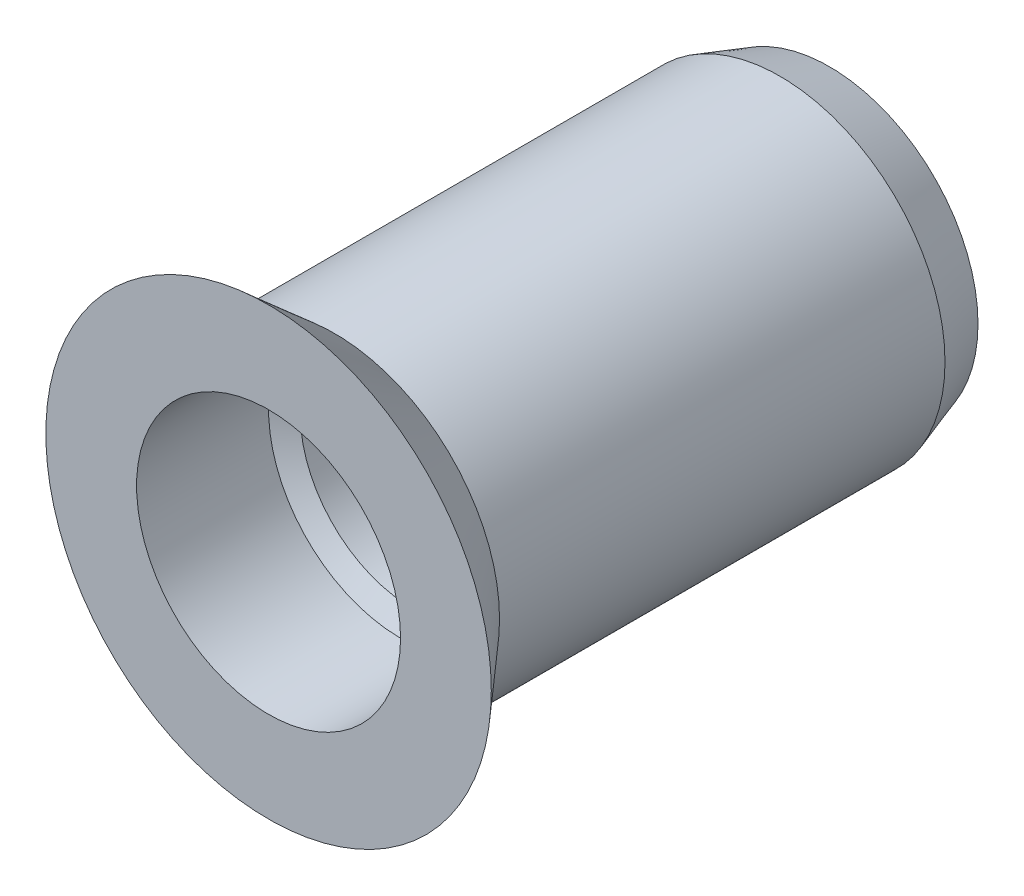
ISO-10303-21;
HEADER;
FILE_DESCRIPTION(('STEP AP214'),'2;1');
FILE_NAME('part.step','',(''),(''),'','','');
FILE_SCHEMA(('AUTOMOTIVE_DESIGN { 1 0 10303 214 1 1 1 1 }'));
ENDSEC;
DATA;
#1=APPLICATION_CONTEXT('core data for automotive mechanical design processes');
#2=APPLICATION_PROTOCOL_DEFINITION('international standard','automotive_design',2000,#1);
#3=PRODUCT_CONTEXT('',#1,'mechanical');
#4=PRODUCT('Part','Part','',(#3));
#5=PRODUCT_RELATED_PRODUCT_CATEGORY('part','',(#4));
#6=PRODUCT_DEFINITION_FORMATION('','',#4);
#7=PRODUCT_DEFINITION_CONTEXT('part definition',#1,'design');
#8=PRODUCT_DEFINITION('design','',#6,#7);
#9=PRODUCT_DEFINITION_SHAPE('','',#8);
#10=(LENGTH_UNIT() NAMED_UNIT(*) SI_UNIT(.MILLI.,.METRE.));
#11=(NAMED_UNIT(*) PLANE_ANGLE_UNIT() SI_UNIT($,.RADIAN.));
#12=(NAMED_UNIT(*) SI_UNIT($,.STERADIAN.) SOLID_ANGLE_UNIT());
#13=UNCERTAINTY_MEASURE_WITH_UNIT(LENGTH_MEASURE(1.E-05),#10,'distance_accuracy_value','');
#14=(GEOMETRIC_REPRESENTATION_CONTEXT(3) GLOBAL_UNCERTAINTY_ASSIGNED_CONTEXT((#13)) GLOBAL_UNIT_ASSIGNED_CONTEXT((#10,
#11,#12)) REPRESENTATION_CONTEXT('',''));
#15=CARTESIAN_POINT('',(0.,0.,0.));
#16=DIRECTION('',(0.,0.,1.));
#17=DIRECTION('',(1.,0.,0.));
#18=AXIS2_PLACEMENT_3D('',#15,#16,#17);
#19=CARTESIAN_POINT('',(0.,0.,-495000.));
#20=DIRECTION('',(0.,0.,-1.));
#21=DIRECTION('',(-1.,0.,0.));
#22=AXIS2_PLACEMENT_3D('',#19,#20,#21);
#23=CYLINDRICAL_SURFACE('',#22,3.4);
#24=CARTESIAN_POINT('',(0.,0.,-4.36051637211676));
#25=DIRECTION('',(0.,0.,1.));
#26=DIRECTION('',(1.,0.,0.));
#27=AXIS2_PLACEMENT_3D('',#24,#25,#26);
#28=CIRCLE('',#27,3.40000000039709);
#29=CARTESIAN_POINT('',(3.40000000039709,0.,-4.36051637211676));
#30=VERTEX_POINT('',#29);
#31=EDGE_CURVE('E41',#30,#30,#28,.T.);
#32=ORIENTED_EDGE('',*,*,#31,.T.);
#33=EDGE_LOOP('',(#32));
#34=FACE_BOUND('',#33,.T.);
#35=CARTESIAN_POINT('',(0.,0.,-16.3999999994076));
#36=DIRECTION('',(0.,0.,-1.));
#37=DIRECTION('',(-1.,0.,0.));
#38=AXIS2_PLACEMENT_3D('',#35,#36,#37);
#39=CIRCLE('',#38,3.40000000051077);
#40=CARTESIAN_POINT('',(-3.40000000051077,0.,-16.3999999994076));
#41=VERTEX_POINT('',#40);
#42=EDGE_CURVE('E36',#41,#41,#39,.T.);
#43=ORIENTED_EDGE('',*,*,#42,.T.);
#44=EDGE_LOOP('',(#43));
#45=FACE_BOUND('',#44,.T.);
#46=ADVANCED_FACE('F14',(#34,#45),#23,.F.);
#47=CARTESIAN_POINT('',(0.,0.,-4.0000000000191));
#48=DIRECTION('',(0.,0.,1.));
#49=DIRECTION('',(1.,0.,0.));
#50=AXIS2_PLACEMENT_3D('',#47,#48,#49);
#51=CONICAL_SURFACE('',#50,3.99999999996226,1.02974425752263);
#52=CARTESIAN_POINT('',(0.,0.,-4.));
#53=DIRECTION('',(0.,0.,1.));
#54=DIRECTION('',(1.,0.,0.));
#55=AXIS2_PLACEMENT_3D('',#52,#53,#54);
#56=CIRCLE('',#55,4.);
#57=CARTESIAN_POINT('',(4.,0.,-4.));
#58=VERTEX_POINT('',#57);
#59=EDGE_CURVE('E33',#58,#58,#56,.T.);
#60=ORIENTED_EDGE('',*,*,#59,.T.);
#61=EDGE_LOOP('',(#60));
#62=FACE_BOUND('',#61,.T.);
#63=ORIENTED_EDGE('',*,*,#31,.F.);
#64=EDGE_LOOP('',(#63));
#65=FACE_BOUND('',#64,.T.);
#66=ADVANCED_FACE('F93',(#62,#65),#51,.F.);
#67=CARTESIAN_POINT('',(0.,0.,-16.9999999999959));
#68=DIRECTION('',(0.,0.,-1.));
#69=DIRECTION('',(-1.,0.,0.));
#70=AXIS2_PLACEMENT_3D('',#67,#68,#69);
#71=CONICAL_SURFACE('',#70,4.0000000000191,0.785398162450058);
#72=CARTESIAN_POINT('',(0.,0.,-16.9999999999959));
#73=DIRECTION('',(0.,0.,-1.));
#74=DIRECTION('',(-1.,0.,0.));
#75=AXIS2_PLACEMENT_3D('',#72,#73,#74);
#76=CIRCLE('',#75,4.0000000000191);
#77=CARTESIAN_POINT('',(-4.0000000000191,0.,-16.9999999999959));
#78=VERTEX_POINT('',#77);
#79=EDGE_CURVE('E17',#78,#78,#76,.T.);
#80=ORIENTED_EDGE('',*,*,#79,.T.);
#81=EDGE_LOOP('',(#80));
#82=FACE_BOUND('',#81,.T.);
#83=ORIENTED_EDGE('',*,*,#42,.F.);
#84=EDGE_LOOP('',(#83));
#85=FACE_BOUND('',#84,.T.);
#86=ADVANCED_FACE('F59',(#82,#85),#71,.F.);
#87=CARTESIAN_POINT('',(0.,0.,-4.));
#88=DIRECTION('',(0.,0.,1.));
#89=DIRECTION('',(1.,0.,0.));
#90=AXIS2_PLACEMENT_3D('',#87,#88,#89);
#91=CYLINDRICAL_SURFACE('',#90,4.);
#92=CARTESIAN_POINT('',(0.,0.,0.));
#93=DIRECTION('',(0.,0.,1.));
#94=DIRECTION('',(1.,0.,0.));
#95=AXIS2_PLACEMENT_3D('',#92,#93,#94);
#96=CIRCLE('',#95,4.);
#97=CARTESIAN_POINT('',(4.,0.,0.));
#98=VERTEX_POINT('',#97);
#99=EDGE_CURVE('E52',#98,#98,#96,.T.);
#100=ORIENTED_EDGE('',*,*,#99,.T.);
#101=EDGE_LOOP('',(#100));
#102=FACE_BOUND('',#101,.T.);
#103=ORIENTED_EDGE('',*,*,#59,.F.);
#104=EDGE_LOOP('',(#103));
#105=FACE_BOUND('',#104,.T.);
#106=ADVANCED_FACE('F66',(#102,#105),#91,.F.);
#107=CARTESIAN_POINT('',(0.,-5.,-17.));
#108=DIRECTION('',(0.,0.,1.));
#109=DIRECTION('',(1.,0.,0.));
#110=AXIS2_PLACEMENT_3D('',#107,#108,#109);
#111=PLANE('',#110);
#112=ORIENTED_EDGE('',*,*,#79,.F.);
#113=EDGE_LOOP('',(#112));
#114=FACE_BOUND('',#113,.T.);
#115=CARTESIAN_POINT('',(0.,0.,-17.0000000000528));
#116=DIRECTION('',(0.,0.,1.));
#117=DIRECTION('',(1.,0.,0.));
#118=AXIS2_PLACEMENT_3D('',#115,#116,#117);
#119=CIRCLE('',#118,4.49999999997885);
#120=CARTESIAN_POINT('',(4.49999999997885,0.,-17.0000000000528));
#121=VERTEX_POINT('',#120);
#122=EDGE_CURVE('E50',#121,#121,#119,.T.);
#123=ORIENTED_EDGE('',*,*,#122,.F.);
#124=EDGE_LOOP('',(#123));
#125=FACE_BOUND('',#124,.T.);
#126=ADVANCED_FACE('F62',(#114,#125),#111,.F.);
#127=CARTESIAN_POINT('',(0.,0.,0.));
#128=DIRECTION('',(0.,0.,-1.));
#129=DIRECTION('',(-1.,0.,0.));
#130=AXIS2_PLACEMENT_3D('',#127,#128,#129);
#131=PLANE('',#130);
#132=CARTESIAN_POINT('',(0.,0.,0.));
#133=DIRECTION('',(0.,0.,1.));
#134=DIRECTION('',(1.,0.,0.));
#135=AXIS2_PLACEMENT_3D('',#132,#133,#134);
#136=CIRCLE('',#135,6.75000000001091);
#137=CARTESIAN_POINT('',(6.75000000001091,0.,0.));
#138=VERTEX_POINT('',#137);
#139=EDGE_CURVE('E26',#138,#138,#136,.F.);
#140=ORIENTED_EDGE('',*,*,#139,.F.);
#141=EDGE_LOOP('',(#140));
#142=FACE_BOUND('',#141,.T.);
#143=ORIENTED_EDGE('',*,*,#99,.F.);
#144=EDGE_LOOP('',(#143));
#145=FACE_BOUND('',#144,.T.);
#146=ADVANCED_FACE('F65',(#142,#145),#131,.F.);
#147=CARTESIAN_POINT('',(0.,0.,-15.499999999804));
#148=DIRECTION('',(0.,0.,1.));
#149=DIRECTION('',(1.,0.,0.));
#150=AXIS2_PLACEMENT_3D('',#147,#148,#149);
#151=CONICAL_SURFACE('',#150,4.99999999942702,0.321750554015791);
#152=ORIENTED_EDGE('',*,*,#122,.T.);
#153=EDGE_LOOP('',(#152));
#154=FACE_BOUND('',#153,.T.);
#155=CARTESIAN_POINT('',(0.,0.,-15.5));
#156=DIRECTION('',(0.,0.,-1.));
#157=DIRECTION('',(-1.,0.,0.));
#158=AXIS2_PLACEMENT_3D('',#155,#156,#157);
#159=CIRCLE('',#158,5.);
#160=CARTESIAN_POINT('',(-5.,0.,-15.5));
#161=VERTEX_POINT('',#160);
#162=EDGE_CURVE('E21',#161,#161,#159,.F.);
#163=ORIENTED_EDGE('',*,*,#162,.F.);
#164=EDGE_LOOP('',(#163));
#165=FACE_BOUND('',#164,.T.);
#166=ADVANCED_FACE('F70',(#154,#165),#151,.T.);
#167=CARTESIAN_POINT('',(0.,0.,0.));
#168=DIRECTION('',(0.,0.,1.));
#169=DIRECTION('',(1.,0.,0.));
#170=AXIS2_PLACEMENT_3D('',#167,#168,#169);
#171=CONICAL_SURFACE('',#170,6.75000000001091,0.718829998800665);
#172=ORIENTED_EDGE('',*,*,#139,.T.);
#173=EDGE_LOOP('',(#172));
#174=FACE_BOUND('',#173,.T.);
#175=CARTESIAN_POINT('',(0.,0.,-2.));
#176=DIRECTION('',(0.,0.,-1.));
#177=DIRECTION('',(-1.,0.,0.));
#178=AXIS2_PLACEMENT_3D('',#175,#176,#177);
#179=CIRCLE('',#178,5.);
#180=CARTESIAN_POINT('',(-5.,0.,-2.));
#181=VERTEX_POINT('',#180);
#182=EDGE_CURVE('E10',#181,#181,#179,.T.);
#183=ORIENTED_EDGE('',*,*,#182,.F.);
#184=EDGE_LOOP('',(#183));
#185=FACE_BOUND('',#184,.T.);
#186=ADVANCED_FACE('F73',(#174,#185),#171,.T.);
#187=CARTESIAN_POINT('',(0.,0.,0.));
#188=DIRECTION('',(0.,0.,-1.));
#189=DIRECTION('',(-1.,0.,0.));
#190=AXIS2_PLACEMENT_3D('',#187,#188,#189);
#191=CYLINDRICAL_SURFACE('',#190,5.);
#192=ORIENTED_EDGE('',*,*,#182,.T.);
#193=EDGE_LOOP('',(#192));
#194=FACE_BOUND('',#193,.T.);
#195=ORIENTED_EDGE('',*,*,#162,.T.);
#196=EDGE_LOOP('',(#195));
#197=FACE_BOUND('',#196,.T.);
#198=ADVANCED_FACE('F77',(#194,#197),#191,.T.);
#199=CLOSED_SHELL('',(#46,#66,#86,#106,#126,#146,#166,#186,#198));
#200=MANIFOLD_SOLID_BREP('B1',#199);
#201=ADVANCED_BREP_SHAPE_REPRESENTATION('',(#18,#200),#14);
#202=SHAPE_DEFINITION_REPRESENTATION(#9,#201);
ENDSEC;
END-ISO-10303-21;
